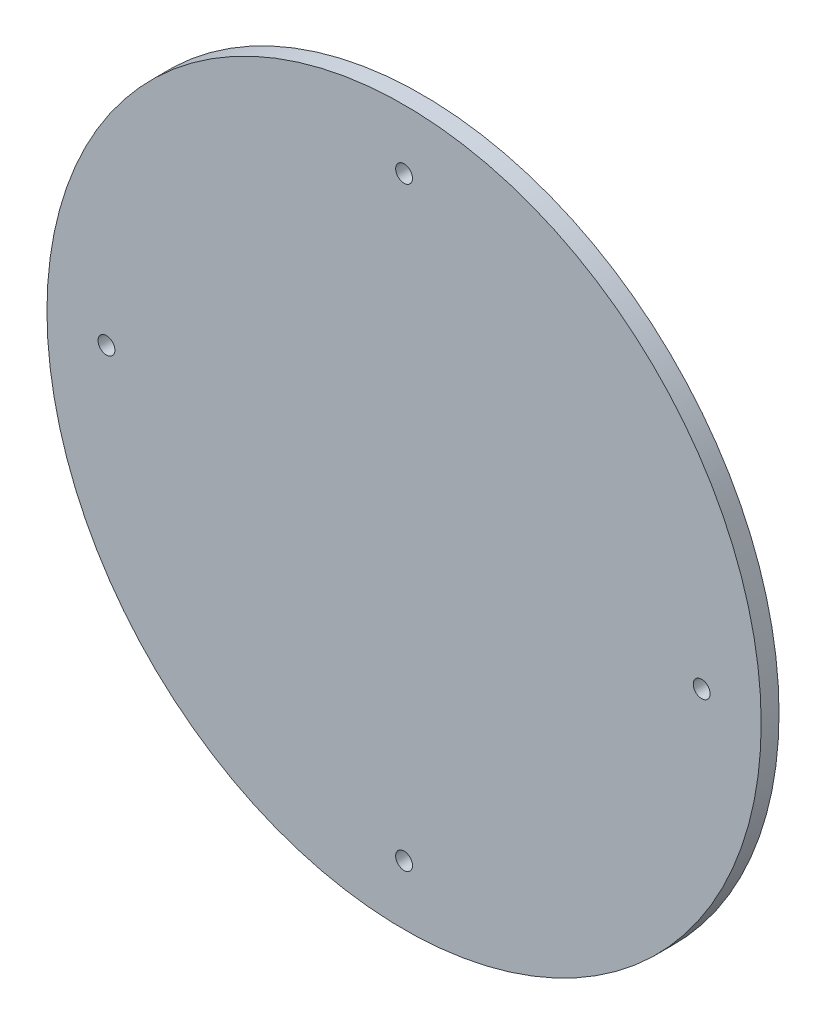
ISO-10303-21;
HEADER;
FILE_DESCRIPTION(('STEP AP214'),'2;1');
FILE_NAME('part.step','',(''),(''),'','','');
FILE_SCHEMA(('AUTOMOTIVE_DESIGN { 1 0 10303 214 1 1 1 1 }'));
ENDSEC;
DATA;
#1=APPLICATION_CONTEXT('core data for automotive mechanical design processes');
#2=APPLICATION_PROTOCOL_DEFINITION('international standard','automotive_design',2000,#1);
#3=PRODUCT_CONTEXT('',#1,'mechanical');
#4=PRODUCT('Part','Part','',(#3));
#5=PRODUCT_RELATED_PRODUCT_CATEGORY('part','',(#4));
#6=PRODUCT_DEFINITION_FORMATION('','',#4);
#7=PRODUCT_DEFINITION_CONTEXT('part definition',#1,'design');
#8=PRODUCT_DEFINITION('design','',#6,#7);
#9=PRODUCT_DEFINITION_SHAPE('','',#8);
#10=(LENGTH_UNIT() NAMED_UNIT(*) SI_UNIT(.MILLI.,.METRE.));
#11=(NAMED_UNIT(*) PLANE_ANGLE_UNIT() SI_UNIT($,.RADIAN.));
#12=(NAMED_UNIT(*) SI_UNIT($,.STERADIAN.) SOLID_ANGLE_UNIT());
#13=UNCERTAINTY_MEASURE_WITH_UNIT(LENGTH_MEASURE(1.E-05),#10,'distance_accuracy_value','');
#14=(GEOMETRIC_REPRESENTATION_CONTEXT(3) GLOBAL_UNCERTAINTY_ASSIGNED_CONTEXT((#13)) GLOBAL_UNIT_ASSIGNED_CONTEXT((#10,
#11,#12)) REPRESENTATION_CONTEXT('',''));
#15=CARTESIAN_POINT('',(0.,0.,0.));
#16=DIRECTION('',(0.,0.,1.));
#17=DIRECTION('',(1.,0.,0.));
#18=AXIS2_PLACEMENT_3D('',#15,#16,#17);
#19=CARTESIAN_POINT('',(0.,0.,4.7625));
#20=DIRECTION('',(0.,0.,-1.));
#21=DIRECTION('',(-1.,0.,0.));
#22=AXIS2_PLACEMENT_3D('',#19,#20,#21);
#23=CYLINDRICAL_SURFACE('',#22,95.25);
#24=CARTESIAN_POINT('',(0.,0.,4.7625));
#25=DIRECTION('',(0.,0.,1.));
#26=DIRECTION('',(1.,0.,0.));
#27=AXIS2_PLACEMENT_3D('',#24,#25,#26);
#28=CIRCLE('',#27,95.25);
#29=CARTESIAN_POINT('',(95.25,0.,4.7625));
#30=VERTEX_POINT('',#29);
#31=EDGE_CURVE('E10',#30,#30,#28,.T.);
#32=ORIENTED_EDGE('',*,*,#31,.F.);
#33=EDGE_LOOP('',(#32));
#34=FACE_BOUND('',#33,.T.);
#35=CARTESIAN_POINT('',(0.,0.,0.));
#36=DIRECTION('',(0.,0.,1.));
#37=DIRECTION('',(1.,0.,0.));
#38=AXIS2_PLACEMENT_3D('',#35,#36,#37);
#39=CIRCLE('',#38,95.25);
#40=CARTESIAN_POINT('',(95.25,0.,0.));
#41=VERTEX_POINT('',#40);
#42=EDGE_CURVE('E40',#41,#41,#39,.T.);
#43=ORIENTED_EDGE('',*,*,#42,.T.);
#44=EDGE_LOOP('',(#43));
#45=FACE_BOUND('',#44,.T.);
#46=ADVANCED_FACE('F33',(#34,#45),#23,.T.);
#47=CARTESIAN_POINT('',(0.,0.,4.7625));
#48=DIRECTION('',(0.,0.,1.));
#49=DIRECTION('',(1.,0.,0.));
#50=AXIS2_PLACEMENT_3D('',#47,#48,#49);
#51=PLANE('',#50);
#52=CARTESIAN_POINT('',(0.,79.375,4.7625));
#53=DIRECTION('',(0.,0.,1.));
#54=DIRECTION('',(1.,0.,0.));
#55=AXIS2_PLACEMENT_3D('',#52,#53,#54);
#56=CIRCLE('',#55,2.2479);
#57=CARTESIAN_POINT('',(2.2479,79.375,4.7625));
#58=VERTEX_POINT('',#57);
#59=EDGE_CURVE('E64',#58,#58,#56,.T.);
#60=ORIENTED_EDGE('',*,*,#59,.F.);
#61=EDGE_LOOP('',(#60));
#62=FACE_BOUND('',#61,.T.);
#63=CARTESIAN_POINT('',(-79.375,0.,4.7625));
#64=DIRECTION('',(0.,0.,1.));
#65=DIRECTION('',(1.,0.,0.));
#66=AXIS2_PLACEMENT_3D('',#63,#64,#65);
#67=CIRCLE('',#66,2.2479);
#68=CARTESIAN_POINT('',(-77.1271,0.,4.7625));
#69=VERTEX_POINT('',#68);
#70=EDGE_CURVE('E61',#69,#69,#67,.T.);
#71=ORIENTED_EDGE('',*,*,#70,.F.);
#72=EDGE_LOOP('',(#71));
#73=FACE_BOUND('',#72,.T.);
#74=CARTESIAN_POINT('',(79.375,0.,4.7625));
#75=DIRECTION('',(0.,0.,1.));
#76=DIRECTION('',(1.,0.,0.));
#77=AXIS2_PLACEMENT_3D('',#74,#75,#76);
#78=CIRCLE('',#77,2.2479);
#79=CARTESIAN_POINT('',(81.6229,0.,4.7625));
#80=VERTEX_POINT('',#79);
#81=EDGE_CURVE('E55',#80,#80,#78,.T.);
#82=ORIENTED_EDGE('',*,*,#81,.F.);
#83=EDGE_LOOP('',(#82));
#84=FACE_BOUND('',#83,.T.);
#85=CARTESIAN_POINT('',(0.,-79.375,4.7625));
#86=DIRECTION('',(0.,0.,1.));
#87=DIRECTION('',(1.,0.,0.));
#88=AXIS2_PLACEMENT_3D('',#85,#86,#87);
#89=CIRCLE('',#88,2.2479);
#90=CARTESIAN_POINT('',(2.2479,-79.375,4.7625));
#91=VERTEX_POINT('',#90);
#92=EDGE_CURVE('E49',#91,#91,#89,.T.);
#93=ORIENTED_EDGE('',*,*,#92,.F.);
#94=EDGE_LOOP('',(#93));
#95=FACE_BOUND('',#94,.T.);
#96=ORIENTED_EDGE('',*,*,#31,.T.);
#97=EDGE_LOOP('',(#96));
#98=FACE_BOUND('',#97,.T.);
#99=ADVANCED_FACE('F85',(#62,#73,#84,#95,#98),#51,.T.);
#100=CARTESIAN_POINT('',(0.,0.,0.));
#101=DIRECTION('',(0.,0.,1.));
#102=DIRECTION('',(1.,0.,0.));
#103=AXIS2_PLACEMENT_3D('',#100,#101,#102);
#104=PLANE('',#103);
#105=CARTESIAN_POINT('',(0.,79.375,0.));
#106=DIRECTION('',(0.,0.,1.));
#107=DIRECTION('',(1.,0.,0.));
#108=AXIS2_PLACEMENT_3D('',#105,#106,#107);
#109=CIRCLE('',#108,2.2479);
#110=CARTESIAN_POINT('',(2.2479,79.375,0.));
#111=VERTEX_POINT('',#110);
#112=EDGE_CURVE('E36',#111,#111,#109,.T.);
#113=ORIENTED_EDGE('',*,*,#112,.T.);
#114=EDGE_LOOP('',(#113));
#115=FACE_BOUND('',#114,.T.);
#116=CARTESIAN_POINT('',(-79.375,0.,0.));
#117=DIRECTION('',(0.,0.,1.));
#118=DIRECTION('',(1.,0.,0.));
#119=AXIS2_PLACEMENT_3D('',#116,#117,#118);
#120=CIRCLE('',#119,2.2479);
#121=CARTESIAN_POINT('',(-77.1271,0.,0.));
#122=VERTEX_POINT('',#121);
#123=EDGE_CURVE('E58',#122,#122,#120,.T.);
#124=ORIENTED_EDGE('',*,*,#123,.T.);
#125=EDGE_LOOP('',(#124));
#126=FACE_BOUND('',#125,.T.);
#127=CARTESIAN_POINT('',(79.375,0.,0.));
#128=DIRECTION('',(0.,0.,1.));
#129=DIRECTION('',(1.,0.,0.));
#130=AXIS2_PLACEMENT_3D('',#127,#128,#129);
#131=CIRCLE('',#130,2.2479);
#132=CARTESIAN_POINT('',(81.6229,0.,0.));
#133=VERTEX_POINT('',#132);
#134=EDGE_CURVE('E52',#133,#133,#131,.T.);
#135=ORIENTED_EDGE('',*,*,#134,.T.);
#136=EDGE_LOOP('',(#135));
#137=FACE_BOUND('',#136,.T.);
#138=CARTESIAN_POINT('',(0.,-79.375,0.));
#139=DIRECTION('',(0.,0.,1.));
#140=DIRECTION('',(1.,0.,0.));
#141=AXIS2_PLACEMENT_3D('',#138,#139,#140);
#142=CIRCLE('',#141,2.2479);
#143=CARTESIAN_POINT('',(2.2479,-79.375,0.));
#144=VERTEX_POINT('',#143);
#145=EDGE_CURVE('E45',#144,#144,#142,.T.);
#146=ORIENTED_EDGE('',*,*,#145,.T.);
#147=EDGE_LOOP('',(#146));
#148=FACE_BOUND('',#147,.T.);
#149=ORIENTED_EDGE('',*,*,#42,.F.);
#150=EDGE_LOOP('',(#149));
#151=FACE_BOUND('',#150,.T.);
#152=ADVANCED_FACE('F71',(#115,#126,#137,#148,#151),#104,.F.);
#153=CARTESIAN_POINT('',(0.,-79.375,4.7625));
#154=DIRECTION('',(0.,0.,1.));
#155=DIRECTION('',(1.,0.,0.));
#156=AXIS2_PLACEMENT_3D('',#153,#154,#155);
#157=CYLINDRICAL_SURFACE('',#156,2.2479);
#158=ORIENTED_EDGE('',*,*,#92,.T.);
#159=EDGE_LOOP('',(#158));
#160=FACE_BOUND('',#159,.T.);
#161=ORIENTED_EDGE('',*,*,#145,.F.);
#162=EDGE_LOOP('',(#161));
#163=FACE_BOUND('',#162,.T.);
#164=ADVANCED_FACE('F97',(#160,#163),#157,.F.);
#165=CARTESIAN_POINT('',(79.375,0.,4.7625));
#166=DIRECTION('',(0.,0.,1.));
#167=DIRECTION('',(1.,0.,0.));
#168=AXIS2_PLACEMENT_3D('',#165,#166,#167);
#169=CYLINDRICAL_SURFACE('',#168,2.2479);
#170=ORIENTED_EDGE('',*,*,#81,.T.);
#171=EDGE_LOOP('',(#170));
#172=FACE_BOUND('',#171,.T.);
#173=ORIENTED_EDGE('',*,*,#134,.F.);
#174=EDGE_LOOP('',(#173));
#175=FACE_BOUND('',#174,.T.);
#176=ADVANCED_FACE('F81',(#172,#175),#169,.F.);
#177=CARTESIAN_POINT('',(-79.375,0.,4.7625));
#178=DIRECTION('',(0.,0.,1.));
#179=DIRECTION('',(1.,0.,0.));
#180=AXIS2_PLACEMENT_3D('',#177,#178,#179);
#181=CYLINDRICAL_SURFACE('',#180,2.2479);
#182=ORIENTED_EDGE('',*,*,#70,.T.);
#183=EDGE_LOOP('',(#182));
#184=FACE_BOUND('',#183,.T.);
#185=ORIENTED_EDGE('',*,*,#123,.F.);
#186=EDGE_LOOP('',(#185));
#187=FACE_BOUND('',#186,.T.);
#188=ADVANCED_FACE('F76',(#184,#187),#181,.F.);
#189=CARTESIAN_POINT('',(0.,79.375,4.7625));
#190=DIRECTION('',(0.,0.,1.));
#191=DIRECTION('',(1.,0.,0.));
#192=AXIS2_PLACEMENT_3D('',#189,#190,#191);
#193=CYLINDRICAL_SURFACE('',#192,2.2479);
#194=ORIENTED_EDGE('',*,*,#59,.T.);
#195=EDGE_LOOP('',(#194));
#196=FACE_BOUND('',#195,.T.);
#197=ORIENTED_EDGE('',*,*,#112,.F.);
#198=EDGE_LOOP('',(#197));
#199=FACE_BOUND('',#198,.T.);
#200=ADVANCED_FACE('F74',(#196,#199),#193,.F.);
#201=CLOSED_SHELL('',(#46,#99,#152,#164,#176,#188,#200));
#202=MANIFOLD_SOLID_BREP('B2',#201);
#203=ADVANCED_BREP_SHAPE_REPRESENTATION('',(#18,#202),#14);
#204=SHAPE_DEFINITION_REPRESENTATION(#9,#203);
ENDSEC;
END-ISO-10303-21;
